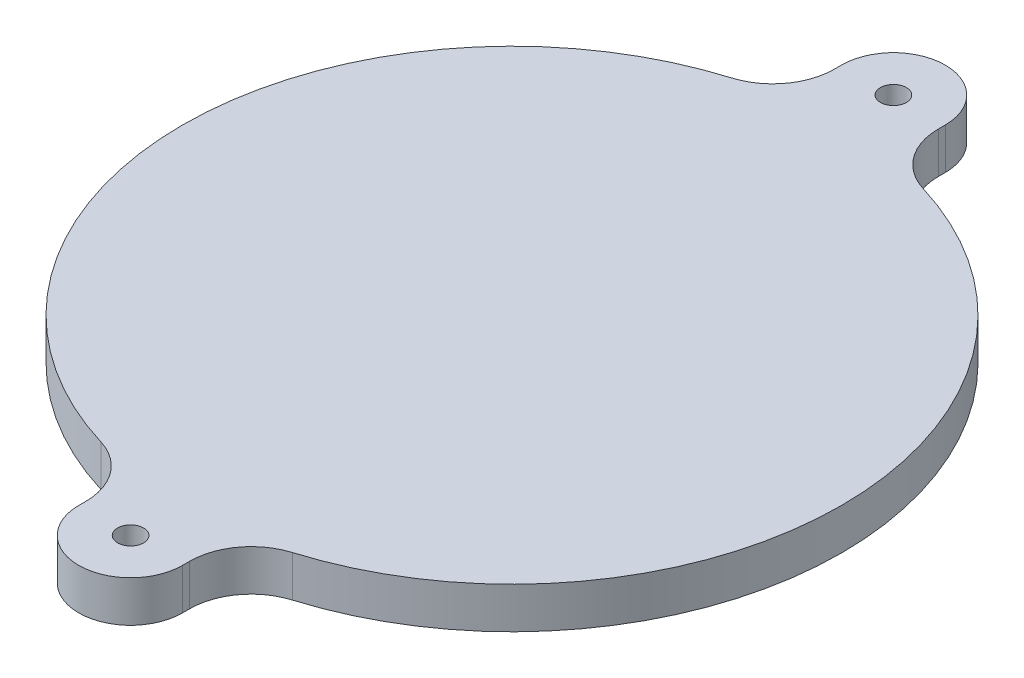
ISO-10303-21;
HEADER;
FILE_DESCRIPTION(('STEP AP214'),'2;1');
FILE_NAME('part.step','',(''),(''),'','','');
FILE_SCHEMA(('AUTOMOTIVE_DESIGN { 1 0 10303 214 1 1 1 1 }'));
ENDSEC;
DATA;
#1=APPLICATION_CONTEXT('core data for automotive mechanical design processes');
#2=APPLICATION_PROTOCOL_DEFINITION('international standard','automotive_design',2000,#1);
#3=PRODUCT_CONTEXT('',#1,'mechanical');
#4=PRODUCT('Part','Part','',(#3));
#5=PRODUCT_RELATED_PRODUCT_CATEGORY('part','',(#4));
#6=PRODUCT_DEFINITION_FORMATION('','',#4);
#7=PRODUCT_DEFINITION_CONTEXT('part definition',#1,'design');
#8=PRODUCT_DEFINITION('design','',#6,#7);
#9=PRODUCT_DEFINITION_SHAPE('','',#8);
#10=(LENGTH_UNIT() NAMED_UNIT(*) SI_UNIT(.MILLI.,.METRE.));
#11=(NAMED_UNIT(*) PLANE_ANGLE_UNIT() SI_UNIT($,.RADIAN.));
#12=(NAMED_UNIT(*) SI_UNIT($,.STERADIAN.) SOLID_ANGLE_UNIT());
#13=UNCERTAINTY_MEASURE_WITH_UNIT(LENGTH_MEASURE(1.E-05),#10,'distance_accuracy_value','');
#14=(GEOMETRIC_REPRESENTATION_CONTEXT(3) GLOBAL_UNCERTAINTY_ASSIGNED_CONTEXT((#13)) GLOBAL_UNIT_ASSIGNED_CONTEXT((#10,
#11,#12)) REPRESENTATION_CONTEXT('',''));
#15=CARTESIAN_POINT('',(0.,0.,0.));
#16=DIRECTION('',(0.,0.,1.));
#17=DIRECTION('',(1.,0.,0.));
#18=AXIS2_PLACEMENT_3D('',#15,#16,#17);
#19=CARTESIAN_POINT('',(4.,-4.571875,0.));
#20=DIRECTION('',(1.,0.,0.));
#21=DIRECTION('',(0.,0.,-1.));
#22=AXIS2_PLACEMENT_3D('',#19,#20,#21);
#23=PLANE('',#22);
#24=DIRECTION('',(0.,0.,-1.));
#25=VECTOR('',#24,1.);
#26=CARTESIAN_POINT('',(4.,-1.396875,0.));
#27=LINE('',#26,#25);
#28=CARTESIAN_POINT('',(4.00000000000001,-1.396875,-28.8616527593276));
#29=VERTEX_POINT('',#28);
#30=CARTESIAN_POINT('',(4.00000000000001,-1.396875,-29.4));
#31=VERTEX_POINT('',#30);
#32=EDGE_CURVE('E179',#29,#31,#27,.T.);
#33=ORIENTED_EDGE('',*,*,#32,.F.);
#34=DIRECTION('',(0.,1.,0.));
#35=VECTOR('',#34,1.);
#36=CARTESIAN_POINT('',(4.00000000000001,-4.571875,-28.8616527593276));
#37=LINE('',#36,#35);
#38=CARTESIAN_POINT('',(4.00000000000001,-4.571875,-28.8616527593276));
#39=VERTEX_POINT('',#38);
#40=EDGE_CURVE('E223',#29,#39,#37,.F.);
#41=ORIENTED_EDGE('',*,*,#40,.T.);
#42=DIRECTION('',(0.,0.,-1.));
#43=VECTOR('',#42,1.);
#44=CARTESIAN_POINT('',(4.,-4.571875,0.));
#45=LINE('',#44,#43);
#46=CARTESIAN_POINT('',(4.00000000000001,-4.571875,-29.4));
#47=VERTEX_POINT('',#46);
#48=EDGE_CURVE('E158',#39,#47,#45,.T.);
#49=ORIENTED_EDGE('',*,*,#48,.T.);
#50=DIRECTION('',(0.,1.,0.));
#51=VECTOR('',#50,1.);
#52=CARTESIAN_POINT('',(4.00000000000001,-4.571875,-29.4));
#53=LINE('',#52,#51);
#54=EDGE_CURVE('E178',#47,#31,#53,.T.);
#55=ORIENTED_EDGE('',*,*,#54,.T.);
#56=EDGE_LOOP('',(#33,#41,#49,#55));
#57=FACE_BOUND('',#56,.T.);
#58=ADVANCED_FACE('F39',(#57),#23,.T.);
#59=CARTESIAN_POINT('',(0.,-4.571875,0.));
#60=DIRECTION('',(0.,1.,0.));
#61=DIRECTION('',(0.,0.,1.));
#62=AXIS2_PLACEMENT_3D('',#59,#60,#61);
#63=CYLINDRICAL_SURFACE('',#62,25.4);
#64=CARTESIAN_POINT('',(0.,-4.571875,0.));
#65=DIRECTION('',(0.,-1.,0.));
#66=DIRECTION('',(0.,0.,-1.));
#67=AXIS2_PLACEMENT_3D('',#64,#65,#66);
#68=CIRCLE('',#67,25.4);
#69=CARTESIAN_POINT('',(7.37894736842106,-4.571875,-24.3045496920653));
#70=VERTEX_POINT('',#69);
#71=CARTESIAN_POINT('',(7.37894736842104,-4.571875,24.3045496920653));
#72=VERTEX_POINT('',#71);
#73=EDGE_CURVE('E155',#70,#72,#68,.T.);
#74=ORIENTED_EDGE('',*,*,#73,.F.);
#75=DIRECTION('',(0.,1.,0.));
#76=VECTOR('',#75,1.);
#77=CARTESIAN_POINT('',(7.37894736842106,-4.571875,-24.3045496920653));
#78=LINE('',#77,#76);
#79=CARTESIAN_POINT('',(7.37894736842106,-1.396875,-24.3045496920653));
#80=VERTEX_POINT('',#79);
#81=EDGE_CURVE('E220',#70,#80,#78,.T.);
#82=ORIENTED_EDGE('',*,*,#81,.T.);
#83=CARTESIAN_POINT('',(0.,-1.396875,0.));
#84=DIRECTION('',(0.,-1.,0.));
#85=DIRECTION('',(0.,0.,-1.));
#86=AXIS2_PLACEMENT_3D('',#83,#84,#85);
#87=CIRCLE('',#86,25.4);
#88=CARTESIAN_POINT('',(7.37894736842104,-1.396875,24.3045496920653));
#89=VERTEX_POINT('',#88);
#90=EDGE_CURVE('E181',#80,#89,#87,.T.);
#91=ORIENTED_EDGE('',*,*,#90,.T.);
#92=DIRECTION('',(0.,1.,0.));
#93=VECTOR('',#92,1.);
#94=CARTESIAN_POINT('',(7.37894736842104,-4.571875,24.3045496920653));
#95=LINE('',#94,#93);
#96=EDGE_CURVE('E218',#89,#72,#95,.F.);
#97=ORIENTED_EDGE('',*,*,#96,.T.);
#98=EDGE_LOOP('',(#74,#82,#91,#97));
#99=FACE_BOUND('',#98,.T.);
#100=ADVANCED_FACE('F245',(#99),#63,.T.);
#101=CARTESIAN_POINT('',(4.,-4.571875,0.));
#102=DIRECTION('',(1.,0.,0.));
#103=DIRECTION('',(0.,0.,-1.));
#104=AXIS2_PLACEMENT_3D('',#101,#102,#103);
#105=PLANE('',#104);
#106=DIRECTION('',(0.,0.,-1.));
#107=VECTOR('',#106,1.);
#108=CARTESIAN_POINT('',(4.,-4.571875,0.));
#109=LINE('',#108,#107);
#110=CARTESIAN_POINT('',(3.99999999999999,-4.571875,29.4));
#111=VERTEX_POINT('',#110);
#112=CARTESIAN_POINT('',(3.99999999999999,-4.571875,28.8616527593276));
#113=VERTEX_POINT('',#112);
#114=EDGE_CURVE('E133',#111,#113,#109,.T.);
#115=ORIENTED_EDGE('',*,*,#114,.T.);
#116=DIRECTION('',(0.,1.,0.));
#117=VECTOR('',#116,1.);
#118=CARTESIAN_POINT('',(3.99999999999999,-4.571875,28.8616527593276));
#119=LINE('',#118,#117);
#120=CARTESIAN_POINT('',(3.99999999999999,-1.396875,28.8616527593276));
#121=VERTEX_POINT('',#120);
#122=EDGE_CURVE('E225',#113,#121,#119,.T.);
#123=ORIENTED_EDGE('',*,*,#122,.T.);
#124=DIRECTION('',(0.,0.,-1.));
#125=VECTOR('',#124,1.);
#126=CARTESIAN_POINT('',(4.,-1.396875,0.));
#127=LINE('',#126,#125);
#128=CARTESIAN_POINT('',(3.99999999999999,-1.396875,29.4));
#129=VERTEX_POINT('',#128);
#130=EDGE_CURVE('E136',#129,#121,#127,.T.);
#131=ORIENTED_EDGE('',*,*,#130,.F.);
#132=DIRECTION('',(0.,1.,0.));
#133=VECTOR('',#132,1.);
#134=CARTESIAN_POINT('',(3.99999999999999,-4.571875,29.4));
#135=LINE('',#134,#133);
#136=EDGE_CURVE('E128',#111,#129,#135,.T.);
#137=ORIENTED_EDGE('',*,*,#136,.F.);
#138=EDGE_LOOP('',(#115,#123,#131,#137));
#139=FACE_BOUND('',#138,.T.);
#140=ADVANCED_FACE('F130',(#139),#105,.T.);
#141=CARTESIAN_POINT('',(0.,-4.571875,29.4));
#142=DIRECTION('',(0.,1.,0.));
#143=DIRECTION('',(0.,0.,1.));
#144=AXIS2_PLACEMENT_3D('',#141,#142,#143);
#145=CYLINDRICAL_SURFACE('',#144,4.);
#146=CARTESIAN_POINT('',(0.,-1.396875,29.4));
#147=DIRECTION('',(0.,-1.,0.));
#148=DIRECTION('',(0.,0.,-1.));
#149=AXIS2_PLACEMENT_3D('',#146,#147,#148);
#150=CIRCLE('',#149,4.);
#151=CARTESIAN_POINT('',(-4.00000000000001,-1.396875,29.4));
#152=VERTEX_POINT('',#151);
#153=EDGE_CURVE('E186',#129,#152,#150,.T.);
#154=ORIENTED_EDGE('',*,*,#153,.T.);
#155=DIRECTION('',(0.,1.,0.));
#156=VECTOR('',#155,1.);
#157=CARTESIAN_POINT('',(-4.00000000000001,-4.571875,29.4));
#158=LINE('',#157,#156);
#159=CARTESIAN_POINT('',(-4.00000000000001,-4.571875,29.4));
#160=VERTEX_POINT('',#159);
#161=EDGE_CURVE('E140',#160,#152,#158,.T.);
#162=ORIENTED_EDGE('',*,*,#161,.F.);
#163=CARTESIAN_POINT('',(0.,-4.571875,29.4));
#164=DIRECTION('',(0.,-1.,0.));
#165=DIRECTION('',(0.,0.,-1.));
#166=AXIS2_PLACEMENT_3D('',#163,#164,#165);
#167=CIRCLE('',#166,4.);
#168=EDGE_CURVE('E143',#111,#160,#167,.T.);
#169=ORIENTED_EDGE('',*,*,#168,.F.);
#170=ORIENTED_EDGE('',*,*,#136,.T.);
#171=EDGE_LOOP('',(#154,#162,#169,#170));
#172=FACE_BOUND('',#171,.T.);
#173=ADVANCED_FACE('F144',(#172),#145,.T.);
#174=CARTESIAN_POINT('',(-4.,-4.571875,0.));
#175=DIRECTION('',(1.,0.,0.));
#176=DIRECTION('',(0.,0.,-1.));
#177=AXIS2_PLACEMENT_3D('',#174,#175,#176);
#178=PLANE('',#177);
#179=DIRECTION('',(0.,0.,-1.));
#180=VECTOR('',#179,1.);
#181=CARTESIAN_POINT('',(-4.,-1.396875,0.));
#182=LINE('',#181,#180);
#183=CARTESIAN_POINT('',(-4.00000000000001,-1.396875,28.8616527593276));
#184=VERTEX_POINT('',#183);
#185=EDGE_CURVE('E188',#152,#184,#182,.T.);
#186=ORIENTED_EDGE('',*,*,#185,.T.);
#187=DIRECTION('',(0.,-1.,0.));
#188=VECTOR('',#187,1.);
#189=CARTESIAN_POINT('',(-4.00000000000001,-4.571875,28.8616527593276));
#190=LINE('',#189,#188);
#191=CARTESIAN_POINT('',(-4.00000000000001,-4.571875,28.8616527593276));
#192=VERTEX_POINT('',#191);
#193=EDGE_CURVE('E54',#184,#192,#190,.T.);
#194=ORIENTED_EDGE('',*,*,#193,.T.);
#195=DIRECTION('',(0.,0.,-1.));
#196=VECTOR('',#195,1.);
#197=CARTESIAN_POINT('',(-4.,-4.571875,0.));
#198=LINE('',#197,#196);
#199=EDGE_CURVE('E147',#160,#192,#198,.T.);
#200=ORIENTED_EDGE('',*,*,#199,.F.);
#201=ORIENTED_EDGE('',*,*,#161,.T.);
#202=EDGE_LOOP('',(#186,#194,#200,#201));
#203=FACE_BOUND('',#202,.T.);
#204=ADVANCED_FACE('F294',(#203),#178,.F.);
#205=CARTESIAN_POINT('',(0.,-4.571875,0.));
#206=DIRECTION('',(0.,1.,0.));
#207=DIRECTION('',(0.,0.,1.));
#208=AXIS2_PLACEMENT_3D('',#205,#206,#207);
#209=CYLINDRICAL_SURFACE('',#208,25.4);
#210=CARTESIAN_POINT('',(0.,-1.396875,0.));
#211=DIRECTION('',(0.,-1.,0.));
#212=DIRECTION('',(0.,0.,-1.));
#213=AXIS2_PLACEMENT_3D('',#210,#211,#212);
#214=CIRCLE('',#213,25.4);
#215=CARTESIAN_POINT('',(-7.37894736842106,-1.396875,24.3045496920653));
#216=VERTEX_POINT('',#215);
#217=CARTESIAN_POINT('',(-7.37894736842105,-1.396875,-24.3045496920653));
#218=VERTEX_POINT('',#217);
#219=EDGE_CURVE('E190',#216,#218,#214,.T.);
#220=ORIENTED_EDGE('',*,*,#219,.T.);
#221=DIRECTION('',(0.,1.,0.));
#222=VECTOR('',#221,1.);
#223=CARTESIAN_POINT('',(-7.37894736842105,-4.571875,-24.3045496920653));
#224=LINE('',#223,#222);
#225=CARTESIAN_POINT('',(-7.37894736842105,-4.571875,-24.3045496920653));
#226=VERTEX_POINT('',#225);
#227=EDGE_CURVE('E216',#218,#226,#224,.F.);
#228=ORIENTED_EDGE('',*,*,#227,.T.);
#229=CARTESIAN_POINT('',(0.,-4.571875,0.));
#230=DIRECTION('',(0.,-1.,0.));
#231=DIRECTION('',(0.,0.,-1.));
#232=AXIS2_PLACEMENT_3D('',#229,#230,#231);
#233=CIRCLE('',#232,25.4);
#234=CARTESIAN_POINT('',(-7.37894736842106,-4.571875,24.3045496920653));
#235=VERTEX_POINT('',#234);
#236=EDGE_CURVE('E163',#235,#226,#233,.T.);
#237=ORIENTED_EDGE('',*,*,#236,.F.);
#238=DIRECTION('',(0.,1.,0.));
#239=VECTOR('',#238,1.);
#240=CARTESIAN_POINT('',(-7.37894736842106,-4.571875,24.3045496920653));
#241=LINE('',#240,#239);
#242=EDGE_CURVE('E213',#235,#216,#241,.T.);
#243=ORIENTED_EDGE('',*,*,#242,.T.);
#244=EDGE_LOOP('',(#220,#228,#237,#243));
#245=FACE_BOUND('',#244,.T.);
#246=ADVANCED_FACE('F291',(#245),#209,.T.);
#247=CARTESIAN_POINT('',(-4.,-4.571875,0.));
#248=DIRECTION('',(1.,0.,0.));
#249=DIRECTION('',(0.,0.,-1.));
#250=AXIS2_PLACEMENT_3D('',#247,#248,#249);
#251=PLANE('',#250);
#252=DIRECTION('',(0.,0.,-1.));
#253=VECTOR('',#252,1.);
#254=CARTESIAN_POINT('',(-4.,-4.571875,0.));
#255=LINE('',#254,#253);
#256=CARTESIAN_POINT('',(-3.99999999999999,-4.571875,-28.8616527593276));
#257=VERTEX_POINT('',#256);
#258=CARTESIAN_POINT('',(-3.99999999999999,-4.571875,-29.4));
#259=VERTEX_POINT('',#258);
#260=EDGE_CURVE('E167',#257,#259,#255,.T.);
#261=ORIENTED_EDGE('',*,*,#260,.F.);
#262=DIRECTION('',(0.,-1.,0.));
#263=VECTOR('',#262,1.);
#264=CARTESIAN_POINT('',(-3.99999999999999,-1.396875,-28.8616527593276));
#265=LINE('',#264,#263);
#266=CARTESIAN_POINT('',(-3.99999999999999,-1.396875,-28.8616527593276));
#267=VERTEX_POINT('',#266);
#268=EDGE_CURVE('E139',#257,#267,#265,.F.);
#269=ORIENTED_EDGE('',*,*,#268,.T.);
#270=DIRECTION('',(0.,0.,-1.));
#271=VECTOR('',#270,1.);
#272=CARTESIAN_POINT('',(-4.,-1.396875,0.));
#273=LINE('',#272,#271);
#274=CARTESIAN_POINT('',(-3.99999999999999,-1.396875,-29.4));
#275=VERTEX_POINT('',#274);
#276=EDGE_CURVE('E194',#267,#275,#273,.T.);
#277=ORIENTED_EDGE('',*,*,#276,.T.);
#278=DIRECTION('',(0.,1.,0.));
#279=VECTOR('',#278,1.);
#280=CARTESIAN_POINT('',(-3.99999999999999,-4.571875,-29.4));
#281=LINE('',#280,#279);
#282=EDGE_CURVE('E207',#259,#275,#281,.T.);
#283=ORIENTED_EDGE('',*,*,#282,.F.);
#284=EDGE_LOOP('',(#261,#269,#277,#283));
#285=FACE_BOUND('',#284,.T.);
#286=ADVANCED_FACE('F281',(#285),#251,.F.);
#287=CARTESIAN_POINT('',(0.,-4.571875,-29.4));
#288=DIRECTION('',(0.,1.,0.));
#289=DIRECTION('',(0.,0.,1.));
#290=AXIS2_PLACEMENT_3D('',#287,#288,#289);
#291=CYLINDRICAL_SURFACE('',#290,0.999999999999999);
#292=CARTESIAN_POINT('',(0.,-4.571875,-29.4));
#293=DIRECTION('',(0.,-1.,0.));
#294=DIRECTION('',(0.,0.,-1.));
#295=AXIS2_PLACEMENT_3D('',#292,#293,#294);
#296=CIRCLE('',#295,0.999999999999999);
#297=CARTESIAN_POINT('',(0.,-4.571875,-30.4));
#298=VERTEX_POINT('',#297);
#299=EDGE_CURVE('E172',#298,#298,#296,.T.);
#300=ORIENTED_EDGE('',*,*,#299,.T.);
#301=EDGE_LOOP('',(#300));
#302=FACE_BOUND('',#301,.T.);
#303=CARTESIAN_POINT('',(0.,-1.396875,-29.4));
#304=DIRECTION('',(0.,-1.,0.));
#305=DIRECTION('',(0.,0.,-1.));
#306=AXIS2_PLACEMENT_3D('',#303,#304,#305);
#307=CIRCLE('',#306,0.999999999999999);
#308=CARTESIAN_POINT('',(0.,-1.396875,-30.4));
#309=VERTEX_POINT('',#308);
#310=EDGE_CURVE('E199',#309,#309,#307,.T.);
#311=ORIENTED_EDGE('',*,*,#310,.F.);
#312=EDGE_LOOP('',(#311));
#313=FACE_BOUND('',#312,.T.);
#314=ADVANCED_FACE('F319',(#302,#313),#291,.F.);
#315=CARTESIAN_POINT('',(0.,-4.571875,-29.4));
#316=DIRECTION('',(0.,1.,0.));
#317=DIRECTION('',(0.,0.,1.));
#318=AXIS2_PLACEMENT_3D('',#315,#316,#317);
#319=CYLINDRICAL_SURFACE('',#318,4.);
#320=CARTESIAN_POINT('',(0.,-1.396875,-29.4));
#321=DIRECTION('',(0.,-1.,0.));
#322=DIRECTION('',(0.,0.,-1.));
#323=AXIS2_PLACEMENT_3D('',#320,#321,#322);
#324=CIRCLE('',#323,4.);
#325=EDGE_CURVE('E196',#275,#31,#324,.T.);
#326=ORIENTED_EDGE('',*,*,#325,.T.);
#327=ORIENTED_EDGE('',*,*,#54,.F.);
#328=CARTESIAN_POINT('',(0.,-4.571875,-29.4));
#329=DIRECTION('',(0.,-1.,0.));
#330=DIRECTION('',(0.,0.,-1.));
#331=AXIS2_PLACEMENT_3D('',#328,#329,#330);
#332=CIRCLE('',#331,4.);
#333=EDGE_CURVE('E169',#259,#47,#332,.T.);
#334=ORIENTED_EDGE('',*,*,#333,.F.);
#335=ORIENTED_EDGE('',*,*,#282,.T.);
#336=EDGE_LOOP('',(#326,#327,#334,#335));
#337=FACE_BOUND('',#336,.T.);
#338=ADVANCED_FACE('F287',(#337),#319,.T.);
#339=CARTESIAN_POINT('',(0.,-4.571875,29.4));
#340=DIRECTION('',(0.,1.,0.));
#341=DIRECTION('',(0.,0.,1.));
#342=AXIS2_PLACEMENT_3D('',#339,#340,#341);
#343=CYLINDRICAL_SURFACE('',#342,1.);
#344=CARTESIAN_POINT('',(0.,-4.571875,29.4));
#345=DIRECTION('',(0.,-1.,0.));
#346=DIRECTION('',(0.,0.,-1.));
#347=AXIS2_PLACEMENT_3D('',#344,#345,#346);
#348=CIRCLE('',#347,1.);
#349=CARTESIAN_POINT('',(0.,-4.571875,28.4));
#350=VERTEX_POINT('',#349);
#351=EDGE_CURVE('E175',#350,#350,#348,.T.);
#352=ORIENTED_EDGE('',*,*,#351,.T.);
#353=EDGE_LOOP('',(#352));
#354=FACE_BOUND('',#353,.T.);
#355=CARTESIAN_POINT('',(0.,-1.396875,29.4));
#356=DIRECTION('',(0.,-1.,0.));
#357=DIRECTION('',(0.,0.,-1.));
#358=AXIS2_PLACEMENT_3D('',#355,#356,#357);
#359=CIRCLE('',#358,1.);
#360=CARTESIAN_POINT('',(0.,-1.396875,28.4));
#361=VERTEX_POINT('',#360);
#362=EDGE_CURVE('E202',#361,#361,#359,.T.);
#363=ORIENTED_EDGE('',*,*,#362,.F.);
#364=EDGE_LOOP('',(#363));
#365=FACE_BOUND('',#364,.T.);
#366=ADVANCED_FACE('F335',(#354,#365),#343,.F.);
#367=CARTESIAN_POINT('',(0.,-4.571875,0.));
#368=DIRECTION('',(0.,-1.,0.));
#369=DIRECTION('',(0.,0.,-1.));
#370=AXIS2_PLACEMENT_3D('',#367,#368,#369);
#371=PLANE('',#370);
#372=ORIENTED_EDGE('',*,*,#48,.F.);
#373=CARTESIAN_POINT('',(8.76250000000001,-4.571875,-28.8616527593276));
#374=DIRECTION('',(0.,-1.,0.));
#375=DIRECTION('',(0.,0.,-1.));
#376=AXIS2_PLACEMENT_3D('',#373,#374,#375);
#377=CIRCLE('',#376,4.7625);
#378=EDGE_CURVE('E234',#39,#70,#377,.F.);
#379=ORIENTED_EDGE('',*,*,#378,.T.);
#380=ORIENTED_EDGE('',*,*,#73,.T.);
#381=CARTESIAN_POINT('',(8.76249999999999,-4.571875,28.8616527593276));
#382=DIRECTION('',(0.,-1.,0.));
#383=DIRECTION('',(0.,0.,-1.));
#384=AXIS2_PLACEMENT_3D('',#381,#382,#383);
#385=CIRCLE('',#384,4.7625);
#386=EDGE_CURVE('E154',#72,#113,#385,.F.);
#387=ORIENTED_EDGE('',*,*,#386,.T.);
#388=ORIENTED_EDGE('',*,*,#114,.F.);
#389=ORIENTED_EDGE('',*,*,#168,.T.);
#390=ORIENTED_EDGE('',*,*,#199,.T.);
#391=CARTESIAN_POINT('',(-8.76250000000001,-4.571875,28.8616527593276));
#392=DIRECTION('',(0.,-1.,0.));
#393=DIRECTION('',(0.,0.,-1.));
#394=AXIS2_PLACEMENT_3D('',#391,#392,#393);
#395=CIRCLE('',#394,4.7625);
#396=EDGE_CURVE('E11',#192,#235,#395,.F.);
#397=ORIENTED_EDGE('',*,*,#396,.T.);
#398=ORIENTED_EDGE('',*,*,#236,.T.);
#399=CARTESIAN_POINT('',(-8.76249999999999,-4.571875,-28.8616527593276));
#400=DIRECTION('',(0.,-1.,0.));
#401=DIRECTION('',(0.,0.,-1.));
#402=AXIS2_PLACEMENT_3D('',#399,#400,#401);
#403=CIRCLE('',#402,4.7625);
#404=EDGE_CURVE('E230',#226,#257,#403,.F.);
#405=ORIENTED_EDGE('',*,*,#404,.T.);
#406=ORIENTED_EDGE('',*,*,#260,.T.);
#407=ORIENTED_EDGE('',*,*,#333,.T.);
#408=EDGE_LOOP('',(#372,#379,#380,#387,#388,#389,#390,#397,#398,#405,#406,#407));
#409=FACE_BOUND('',#408,.T.);
#410=ORIENTED_EDGE('',*,*,#299,.F.);
#411=EDGE_LOOP('',(#410));
#412=FACE_BOUND('',#411,.T.);
#413=ORIENTED_EDGE('',*,*,#351,.F.);
#414=EDGE_LOOP('',(#413));
#415=FACE_BOUND('',#414,.T.);
#416=ADVANCED_FACE('F150',(#409,#412,#415),#371,.T.);
#417=CARTESIAN_POINT('',(0.,-1.396875,0.));
#418=DIRECTION('',(0.,-1.,0.));
#419=DIRECTION('',(0.,0.,-1.));
#420=AXIS2_PLACEMENT_3D('',#417,#418,#419);
#421=PLANE('',#420);
#422=ORIENTED_EDGE('',*,*,#90,.F.);
#423=CARTESIAN_POINT('',(8.76250000000001,-1.396875,-28.8616527593276));
#424=DIRECTION('',(0.,-1.,0.));
#425=DIRECTION('',(0.,0.,-1.));
#426=AXIS2_PLACEMENT_3D('',#423,#424,#425);
#427=CIRCLE('',#426,4.7625);
#428=EDGE_CURVE('E232',#80,#29,#427,.T.);
#429=ORIENTED_EDGE('',*,*,#428,.T.);
#430=ORIENTED_EDGE('',*,*,#32,.T.);
#431=ORIENTED_EDGE('',*,*,#325,.F.);
#432=ORIENTED_EDGE('',*,*,#276,.F.);
#433=CARTESIAN_POINT('',(-8.76249999999999,-1.396875,-28.8616527593276));
#434=DIRECTION('',(0.,-1.,0.));
#435=DIRECTION('',(0.,0.,-1.));
#436=AXIS2_PLACEMENT_3D('',#433,#434,#435);
#437=CIRCLE('',#436,4.7625);
#438=EDGE_CURVE('E228',#267,#218,#437,.T.);
#439=ORIENTED_EDGE('',*,*,#438,.T.);
#440=ORIENTED_EDGE('',*,*,#219,.F.);
#441=CARTESIAN_POINT('',(-8.76250000000001,-1.396875,28.8616527593276));
#442=DIRECTION('',(0.,-1.,0.));
#443=DIRECTION('',(0.,0.,-1.));
#444=AXIS2_PLACEMENT_3D('',#441,#442,#443);
#445=CIRCLE('',#444,4.7625);
#446=EDGE_CURVE('E47',#216,#184,#445,.T.);
#447=ORIENTED_EDGE('',*,*,#446,.T.);
#448=ORIENTED_EDGE('',*,*,#185,.F.);
#449=ORIENTED_EDGE('',*,*,#153,.F.);
#450=ORIENTED_EDGE('',*,*,#130,.T.);
#451=CARTESIAN_POINT('',(8.76249999999999,-1.396875,28.8616527593276));
#452=DIRECTION('',(0.,-1.,0.));
#453=DIRECTION('',(0.,0.,-1.));
#454=AXIS2_PLACEMENT_3D('',#451,#452,#453);
#455=CIRCLE('',#454,4.7625);
#456=EDGE_CURVE('E236',#121,#89,#455,.T.);
#457=ORIENTED_EDGE('',*,*,#456,.T.);
#458=EDGE_LOOP('',(#422,#429,#430,#431,#432,#439,#440,#447,#448,#449,#450,#457));
#459=FACE_BOUND('',#458,.T.);
#460=ORIENTED_EDGE('',*,*,#310,.T.);
#461=EDGE_LOOP('',(#460));
#462=FACE_BOUND('',#461,.T.);
#463=ORIENTED_EDGE('',*,*,#362,.T.);
#464=EDGE_LOOP('',(#463));
#465=FACE_BOUND('',#464,.T.);
#466=ADVANCED_FACE('F239',(#459,#462,#465),#421,.F.);
#467=CARTESIAN_POINT('',(-8.76249999999999,-4.571875,-28.8616527593276));
#468=DIRECTION('',(0.,1.,0.));
#469=DIRECTION('',(0.,0.,1.));
#470=AXIS2_PLACEMENT_3D('',#467,#468,#469);
#471=CYLINDRICAL_SURFACE('',#470,4.7625);
#472=ORIENTED_EDGE('',*,*,#404,.F.);
#473=ORIENTED_EDGE('',*,*,#227,.F.);
#474=ORIENTED_EDGE('',*,*,#438,.F.);
#475=ORIENTED_EDGE('',*,*,#268,.F.);
#476=EDGE_LOOP('',(#472,#473,#474,#475));
#477=FACE_BOUND('',#476,.T.);
#478=ADVANCED_FACE('F255',(#477),#471,.F.);
#479=CARTESIAN_POINT('',(8.76250000000001,-4.571875,-28.8616527593276));
#480=DIRECTION('',(0.,1.,0.));
#481=DIRECTION('',(0.,0.,1.));
#482=AXIS2_PLACEMENT_3D('',#479,#480,#481);
#483=CYLINDRICAL_SURFACE('',#482,4.7625);
#484=ORIENTED_EDGE('',*,*,#378,.F.);
#485=ORIENTED_EDGE('',*,*,#40,.F.);
#486=ORIENTED_EDGE('',*,*,#428,.F.);
#487=ORIENTED_EDGE('',*,*,#81,.F.);
#488=EDGE_LOOP('',(#484,#485,#486,#487));
#489=FACE_BOUND('',#488,.T.);
#490=ADVANCED_FACE('F249',(#489),#483,.F.);
#491=CARTESIAN_POINT('',(8.76249999999999,-4.571875,28.8616527593276));
#492=DIRECTION('',(0.,1.,0.));
#493=DIRECTION('',(0.,0.,1.));
#494=AXIS2_PLACEMENT_3D('',#491,#492,#493);
#495=CYLINDRICAL_SURFACE('',#494,4.7625);
#496=ORIENTED_EDGE('',*,*,#386,.F.);
#497=ORIENTED_EDGE('',*,*,#96,.F.);
#498=ORIENTED_EDGE('',*,*,#456,.F.);
#499=ORIENTED_EDGE('',*,*,#122,.F.);
#500=EDGE_LOOP('',(#496,#497,#498,#499));
#501=FACE_BOUND('',#500,.T.);
#502=ADVANCED_FACE('F247',(#501),#495,.F.);
#503=CARTESIAN_POINT('',(-8.76250000000001,-4.571875,28.8616527593276));
#504=DIRECTION('',(0.,1.,0.));
#505=DIRECTION('',(0.,0.,1.));
#506=AXIS2_PLACEMENT_3D('',#503,#504,#505);
#507=CYLINDRICAL_SURFACE('',#506,4.7625);
#508=ORIENTED_EDGE('',*,*,#396,.F.);
#509=ORIENTED_EDGE('',*,*,#193,.F.);
#510=ORIENTED_EDGE('',*,*,#446,.F.);
#511=ORIENTED_EDGE('',*,*,#242,.F.);
#512=EDGE_LOOP('',(#508,#509,#510,#511));
#513=FACE_BOUND('',#512,.T.);
#514=ADVANCED_FACE('F41',(#513),#507,.F.);
#515=CLOSED_SHELL('',(#58,#100,#140,#173,#204,#246,#286,#314,#338,#366,#416,#466,#478,#490,#502,#514));
#516=MANIFOLD_SOLID_BREP('B2',#515);
#517=ADVANCED_BREP_SHAPE_REPRESENTATION('',(#18,#516),#14);
#518=SHAPE_DEFINITION_REPRESENTATION(#9,#517);
ENDSEC;
END-ISO-10303-21;
